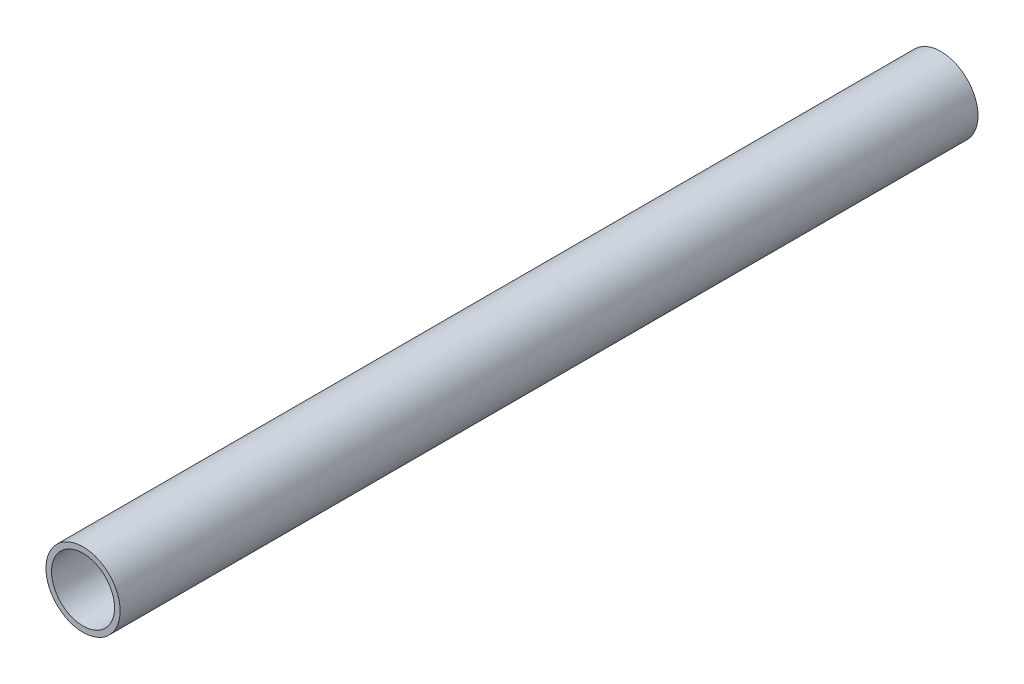
ISO-10303-21;
HEADER;
FILE_DESCRIPTION(('STEP AP214'),'2;1');
FILE_NAME('part.step','',(''),(''),'','','');
FILE_SCHEMA(('AUTOMOTIVE_DESIGN { 1 0 10303 214 1 1 1 1 }'));
ENDSEC;
DATA;
#1=APPLICATION_CONTEXT('core data for automotive mechanical design processes');
#2=APPLICATION_PROTOCOL_DEFINITION('international standard','automotive_design',2000,#1);
#3=PRODUCT_CONTEXT('',#1,'mechanical');
#4=PRODUCT('Part','Part','',(#3));
#5=PRODUCT_RELATED_PRODUCT_CATEGORY('part','',(#4));
#6=PRODUCT_DEFINITION_FORMATION('','',#4);
#7=PRODUCT_DEFINITION_CONTEXT('part definition',#1,'design');
#8=PRODUCT_DEFINITION('design','',#6,#7);
#9=PRODUCT_DEFINITION_SHAPE('','',#8);
#10=(LENGTH_UNIT() NAMED_UNIT(*) SI_UNIT(.MILLI.,.METRE.));
#11=(NAMED_UNIT(*) PLANE_ANGLE_UNIT() SI_UNIT($,.RADIAN.));
#12=(NAMED_UNIT(*) SI_UNIT($,.STERADIAN.) SOLID_ANGLE_UNIT());
#13=UNCERTAINTY_MEASURE_WITH_UNIT(LENGTH_MEASURE(1.E-05),#10,'distance_accuracy_value','');
#14=(GEOMETRIC_REPRESENTATION_CONTEXT(3) GLOBAL_UNCERTAINTY_ASSIGNED_CONTEXT((#13)) GLOBAL_UNIT_ASSIGNED_CONTEXT((#10,
#11,#12)) REPRESENTATION_CONTEXT('',''));
#15=CARTESIAN_POINT('',(0.,0.,0.));
#16=DIRECTION('',(0.,0.,1.));
#17=DIRECTION('',(1.,0.,0.));
#18=AXIS2_PLACEMENT_3D('',#15,#16,#17);
#19=CARTESIAN_POINT('',(0.,0.,0.));
#20=DIRECTION('',(0.,0.,1.));
#21=DIRECTION('',(1.,0.,0.));
#22=AXIS2_PLACEMENT_3D('',#19,#20,#21);
#23=CYLINDRICAL_SURFACE('',#22,6.8);
#24=CARTESIAN_POINT('',(0.,0.,185.));
#25=DIRECTION('',(0.,0.,-1.));
#26=DIRECTION('',(0.,-1.,0.));
#27=AXIS2_PLACEMENT_3D('',#24,#25,#26);
#28=CIRCLE('',#27,6.8);
#29=CARTESIAN_POINT('',(0.,-6.8,185.));
#30=VERTEX_POINT('',#29);
#31=EDGE_CURVE('E26',#30,#30,#28,.T.);
#32=ORIENTED_EDGE('',*,*,#31,.F.);
#33=EDGE_LOOP('',(#32));
#34=FACE_BOUND('',#33,.T.);
#35=CARTESIAN_POINT('',(0.,0.,0.));
#36=DIRECTION('',(0.,0.,-1.));
#37=DIRECTION('',(0.,-1.,0.));
#38=AXIS2_PLACEMENT_3D('',#35,#36,#37);
#39=CIRCLE('',#38,6.8);
#40=CARTESIAN_POINT('',(0.,-6.8,0.));
#41=VERTEX_POINT('',#40);
#42=EDGE_CURVE('E9',#41,#41,#39,.T.);
#43=ORIENTED_EDGE('',*,*,#42,.T.);
#44=EDGE_LOOP('',(#43));
#45=FACE_BOUND('',#44,.T.);
#46=ADVANCED_FACE('F14',(#34,#45),#23,.F.);
#47=CARTESIAN_POINT('',(0.,0.,0.));
#48=DIRECTION('',(0.,0.,1.));
#49=DIRECTION('',(1.,0.,0.));
#50=AXIS2_PLACEMENT_3D('',#47,#48,#49);
#51=CYLINDRICAL_SURFACE('',#50,8.);
#52=CARTESIAN_POINT('',(0.,0.,185.));
#53=DIRECTION('',(0.,0.,1.));
#54=DIRECTION('',(1.,0.,0.));
#55=AXIS2_PLACEMENT_3D('',#52,#53,#54);
#56=CIRCLE('',#55,8.);
#57=CARTESIAN_POINT('',(8.,0.,185.));
#58=VERTEX_POINT('',#57);
#59=EDGE_CURVE('E28',#58,#58,#56,.T.);
#60=ORIENTED_EDGE('',*,*,#59,.F.);
#61=EDGE_LOOP('',(#60));
#62=FACE_BOUND('',#61,.T.);
#63=CARTESIAN_POINT('',(0.,0.,0.));
#64=DIRECTION('',(0.,0.,1.));
#65=DIRECTION('',(1.,0.,0.));
#66=AXIS2_PLACEMENT_3D('',#63,#64,#65);
#67=CIRCLE('',#66,8.);
#68=CARTESIAN_POINT('',(8.,0.,0.));
#69=VERTEX_POINT('',#68);
#70=EDGE_CURVE('E18',#69,#69,#67,.T.);
#71=ORIENTED_EDGE('',*,*,#70,.T.);
#72=EDGE_LOOP('',(#71));
#73=FACE_BOUND('',#72,.T.);
#74=ADVANCED_FACE('F16',(#62,#73),#51,.T.);
#75=CARTESIAN_POINT('',(0.,0.,185.));
#76=DIRECTION('',(0.,0.,1.));
#77=DIRECTION('',(1.,0.,0.));
#78=AXIS2_PLACEMENT_3D('',#75,#76,#77);
#79=PLANE('',#78);
#80=ORIENTED_EDGE('',*,*,#31,.T.);
#81=EDGE_LOOP('',(#80));
#82=FACE_BOUND('',#81,.T.);
#83=ORIENTED_EDGE('',*,*,#59,.T.);
#84=EDGE_LOOP('',(#83));
#85=FACE_BOUND('',#84,.T.);
#86=ADVANCED_FACE('F35',(#82,#85),#79,.T.);
#87=CARTESIAN_POINT('',(0.,0.,0.));
#88=DIRECTION('',(0.,0.,1.));
#89=DIRECTION('',(1.,0.,0.));
#90=AXIS2_PLACEMENT_3D('',#87,#88,#89);
#91=PLANE('',#90);
#92=ORIENTED_EDGE('',*,*,#42,.F.);
#93=EDGE_LOOP('',(#92));
#94=FACE_BOUND('',#93,.T.);
#95=ORIENTED_EDGE('',*,*,#70,.F.);
#96=EDGE_LOOP('',(#95));
#97=FACE_BOUND('',#96,.T.);
#98=ADVANCED_FACE('F44',(#94,#97),#91,.F.);
#99=CLOSED_SHELL('',(#46,#74,#86,#98));
#100=MANIFOLD_SOLID_BREP('B1',#99);
#101=ADVANCED_BREP_SHAPE_REPRESENTATION('',(#18,#100),#14);
#102=SHAPE_DEFINITION_REPRESENTATION(#9,#101);
ENDSEC;
END-ISO-10303-21;
